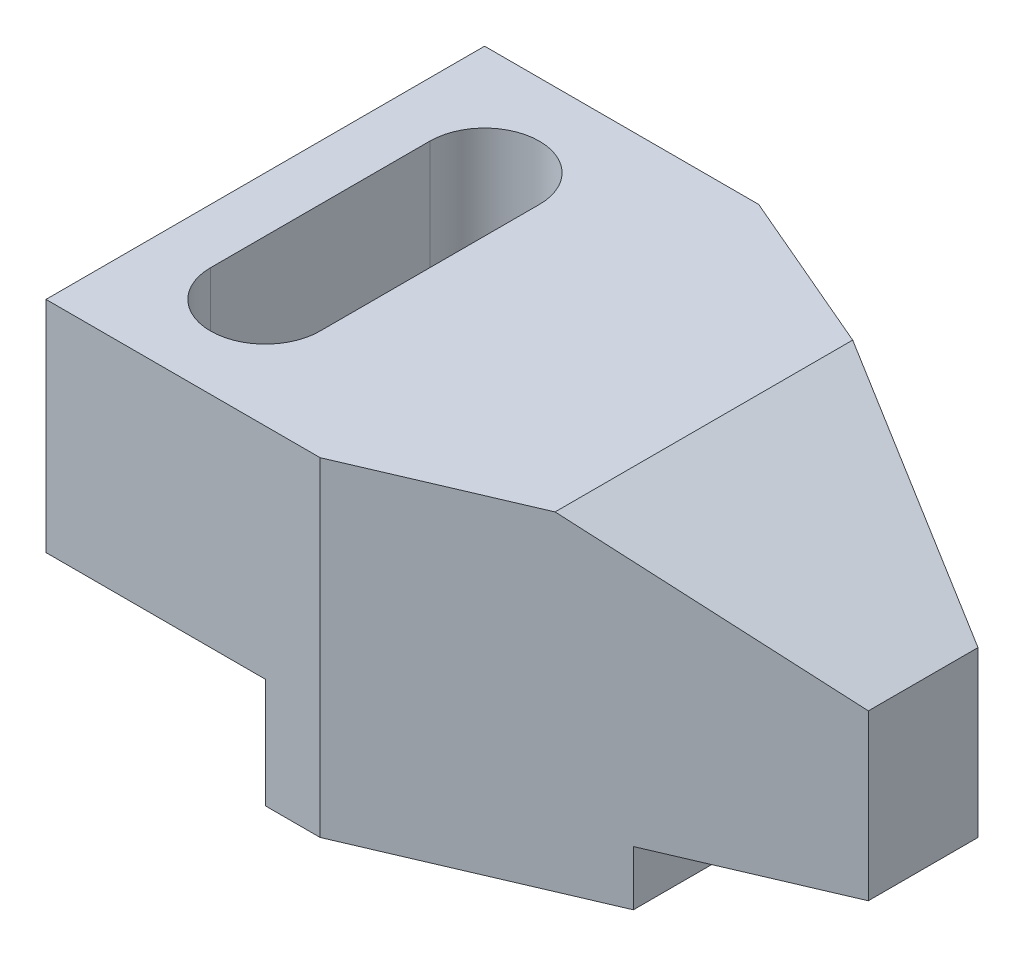
ISO-10303-21;
HEADER;
FILE_DESCRIPTION(('STEP AP214'),'2;1');
FILE_NAME('part.step','',(''),(''),'','','');
FILE_SCHEMA(('AUTOMOTIVE_DESIGN { 1 0 10303 214 1 1 1 1 }'));
ENDSEC;
DATA;
#1=APPLICATION_CONTEXT('core data for automotive mechanical design processes');
#2=APPLICATION_PROTOCOL_DEFINITION('international standard','automotive_design',2000,#1);
#3=PRODUCT_CONTEXT('',#1,'mechanical');
#4=PRODUCT('Part','Part','',(#3));
#5=PRODUCT_RELATED_PRODUCT_CATEGORY('part','',(#4));
#6=PRODUCT_DEFINITION_FORMATION('','',#4);
#7=PRODUCT_DEFINITION_CONTEXT('part definition',#1,'design');
#8=PRODUCT_DEFINITION('design','',#6,#7);
#9=PRODUCT_DEFINITION_SHAPE('','',#8);
#10=(LENGTH_UNIT() NAMED_UNIT(*) SI_UNIT(.MILLI.,.METRE.));
#11=(NAMED_UNIT(*) PLANE_ANGLE_UNIT() SI_UNIT($,.RADIAN.));
#12=(NAMED_UNIT(*) SI_UNIT($,.STERADIAN.) SOLID_ANGLE_UNIT());
#13=UNCERTAINTY_MEASURE_WITH_UNIT(LENGTH_MEASURE(1.E-05),#10,'distance_accuracy_value','');
#14=(GEOMETRIC_REPRESENTATION_CONTEXT(3) GLOBAL_UNCERTAINTY_ASSIGNED_CONTEXT((#13)) GLOBAL_UNIT_ASSIGNED_CONTEXT((#10,
#11,#12)) REPRESENTATION_CONTEXT('',''));
#15=CARTESIAN_POINT('',(0.,0.,0.));
#16=DIRECTION('',(0.,0.,1.));
#17=DIRECTION('',(1.,0.,0.));
#18=AXIS2_PLACEMENT_3D('',#15,#16,#17);
#19=CARTESIAN_POINT('',(100.,60.,0.));
#20=DIRECTION('',(1.,0.,0.));
#21=DIRECTION('',(0.,0.,-1.));
#22=AXIS2_PLACEMENT_3D('',#19,#20,#21);
#23=PLANE('',#22);
#24=DIRECTION('',(0.,0.,1.));
#25=VECTOR('',#24,1.);
#26=CARTESIAN_POINT('',(100.,40.,-40.));
#27=LINE('',#26,#25);
#28=CARTESIAN_POINT('',(100.,40.,-9.99999999999999));
#29=VERTEX_POINT('',#28);
#30=CARTESIAN_POINT('',(100.,40.,9.99999999999999));
#31=VERTEX_POINT('',#30);
#32=EDGE_CURVE('E138',#29,#31,#27,.T.);
#33=ORIENTED_EDGE('',*,*,#32,.T.);
#34=DIRECTION('',(0.,-1.,0.));
#35=VECTOR('',#34,1.);
#36=CARTESIAN_POINT('',(100.,60.,10.));
#37=LINE('',#36,#35);
#38=CARTESIAN_POINT('',(100.,10.,9.99999999999999));
#39=VERTEX_POINT('',#38);
#40=EDGE_CURVE('E158',#31,#39,#37,.T.);
#41=ORIENTED_EDGE('',*,*,#40,.T.);
#42=DIRECTION('',(0.,0.,1.));
#43=VECTOR('',#42,1.);
#44=CARTESIAN_POINT('',(100.,10.,0.));
#45=LINE('',#44,#43);
#46=CARTESIAN_POINT('',(100.,10.,-9.99999999999999));
#47=VERTEX_POINT('',#46);
#48=EDGE_CURVE('E157',#47,#39,#45,.T.);
#49=ORIENTED_EDGE('',*,*,#48,.F.);
#50=DIRECTION('',(0.,-1.,0.));
#51=VECTOR('',#50,1.);
#52=CARTESIAN_POINT('',(100.,60.,-9.99999999999999));
#53=LINE('',#52,#51);
#54=EDGE_CURVE('E150',#29,#47,#53,.T.);
#55=ORIENTED_EDGE('',*,*,#54,.F.);
#56=EDGE_LOOP('',(#33,#41,#49,#55));
#57=FACE_BOUND('',#56,.T.);
#58=ADVANCED_FACE('F33',(#57),#23,.T.);
#59=CARTESIAN_POINT('',(-20.,60.,0.));
#60=DIRECTION('',(-1.,0.,0.));
#61=DIRECTION('',(0.,0.,1.));
#62=AXIS2_PLACEMENT_3D('',#59,#60,#61);
#63=PLANE('',#62);
#64=DIRECTION('',(0.,0.,1.));
#65=VECTOR('',#64,1.);
#66=CARTESIAN_POINT('',(-20.,20.,-40.));
#67=LINE('',#66,#65);
#68=CARTESIAN_POINT('',(-20.,20.,-40.));
#69=VERTEX_POINT('',#68);
#70=CARTESIAN_POINT('',(-20.,20.,40.));
#71=VERTEX_POINT('',#70);
#72=EDGE_CURVE('E231',#69,#71,#67,.T.);
#73=ORIENTED_EDGE('',*,*,#72,.T.);
#74=DIRECTION('',(0.,-1.,0.));
#75=VECTOR('',#74,1.);
#76=CARTESIAN_POINT('',(-20.,60.,40.));
#77=LINE('',#76,#75);
#78=CARTESIAN_POINT('',(-20.,60.,40.));
#79=VERTEX_POINT('',#78);
#80=EDGE_CURVE('E169',#79,#71,#77,.T.);
#81=ORIENTED_EDGE('',*,*,#80,.F.);
#82=DIRECTION('',(0.,0.,-1.));
#83=VECTOR('',#82,1.);
#84=CARTESIAN_POINT('',(-20.,60.,0.));
#85=LINE('',#84,#83);
#86=CARTESIAN_POINT('',(-20.,60.,-40.));
#87=VERTEX_POINT('',#86);
#88=EDGE_CURVE('E238',#79,#87,#85,.T.);
#89=ORIENTED_EDGE('',*,*,#88,.T.);
#90=DIRECTION('',(0.,-1.,0.));
#91=VECTOR('',#90,1.);
#92=CARTESIAN_POINT('',(-20.,60.,-40.));
#93=LINE('',#92,#91);
#94=EDGE_CURVE('E163',#87,#69,#93,.T.);
#95=ORIENTED_EDGE('',*,*,#94,.T.);
#96=EDGE_LOOP('',(#73,#81,#89,#95));
#97=FACE_BOUND('',#96,.T.);
#98=ADVANCED_FACE('F35',(#97),#63,.T.);
#99=CARTESIAN_POINT('',(0.,60.,40.));
#100=DIRECTION('',(0.,0.,1.));
#101=DIRECTION('',(1.,0.,0.));
#102=AXIS2_PLACEMENT_3D('',#99,#100,#101);
#103=PLANE('',#102);
#104=DIRECTION('',(-1.,0.,0.));
#105=VECTOR('',#104,1.);
#106=CARTESIAN_POINT('',(-20.,20.,40.));
#107=LINE('',#106,#105);
#108=CARTESIAN_POINT('',(20.,20.,40.));
#109=VERTEX_POINT('',#108);
#110=EDGE_CURVE('E224',#109,#71,#107,.T.);
#111=ORIENTED_EDGE('',*,*,#110,.F.);
#112=DIRECTION('',(0.,1.,0.));
#113=VECTOR('',#112,1.);
#114=CARTESIAN_POINT('',(20.,0.,40.));
#115=LINE('',#114,#113);
#116=CARTESIAN_POINT('',(20.,0.,40.));
#117=VERTEX_POINT('',#116);
#118=EDGE_CURVE('E218',#117,#109,#115,.T.);
#119=ORIENTED_EDGE('',*,*,#118,.F.);
#120=DIRECTION('',(-1.,0.,0.));
#121=VECTOR('',#120,1.);
#122=CARTESIAN_POINT('',(0.,0.,40.));
#123=LINE('',#122,#121);
#124=CARTESIAN_POINT('',(30.,0.,40.));
#125=VERTEX_POINT('',#124);
#126=EDGE_CURVE('E234',#125,#117,#123,.T.);
#127=ORIENTED_EDGE('',*,*,#126,.F.);
#128=DIRECTION('',(0.,-1.,0.));
#129=VECTOR('',#128,1.);
#130=CARTESIAN_POINT('',(30.,60.,40.));
#131=LINE('',#130,#129);
#132=CARTESIAN_POINT('',(30.,60.,40.));
#133=VERTEX_POINT('',#132);
#134=EDGE_CURVE('E161',#133,#125,#131,.T.);
#135=ORIENTED_EDGE('',*,*,#134,.F.);
#136=DIRECTION('',(-1.,0.,0.));
#137=VECTOR('',#136,1.);
#138=CARTESIAN_POINT('',(0.,60.,40.));
#139=LINE('',#138,#137);
#140=EDGE_CURVE('E241',#133,#79,#139,.T.);
#141=ORIENTED_EDGE('',*,*,#140,.T.);
#142=ORIENTED_EDGE('',*,*,#80,.T.);
#143=EDGE_LOOP('',(#111,#119,#127,#135,#141,#142));
#144=FACE_BOUND('',#143,.T.);
#145=ADVANCED_FACE('F269',(#144),#103,.T.);
#146=CARTESIAN_POINT('',(19.1379310344828,60.,44.6551724137931));
#147=DIRECTION('',(0.393919298579168,0.,0.919145030018058));
#148=DIRECTION('',(0.919145030018058,0.,-0.393919298579168));
#149=AXIS2_PLACEMENT_3D('',#146,#147,#148);
#150=PLANE('',#149);
#151=DIRECTION('',(0.835169980780651,-0.417584990390326,-0.357929991763136));
#152=VECTOR('',#151,1.);
#153=CARTESIAN_POINT('',(26.2633451957295,76.8683274021352,41.6014234875445));
#154=LINE('',#153,#152);
#155=CARTESIAN_POINT('',(60.,60.,27.1428571428571));
#156=VERTEX_POINT('',#155);
#157=EDGE_CURVE('E141',#156,#31,#154,.T.);
#158=ORIENTED_EDGE('',*,*,#157,.F.);
#159=DIRECTION('',(-0.919145030018058,0.,0.393919298579168));
#160=VECTOR('',#159,1.);
#161=CARTESIAN_POINT('',(19.1379310344828,60.,44.6551724137931));
#162=LINE('',#161,#160);
#163=EDGE_CURVE('E245',#156,#133,#162,.T.);
#164=ORIENTED_EDGE('',*,*,#163,.T.);
#165=ORIENTED_EDGE('',*,*,#134,.T.);
#166=DIRECTION('',(-0.919145030018058,0.,0.393919298579168));
#167=VECTOR('',#166,1.);
#168=CARTESIAN_POINT('',(19.1379310344828,0.,44.6551724137931));
#169=LINE('',#168,#167);
#170=CARTESIAN_POINT('',(70.,0.,22.8571428571429));
#171=VERTEX_POINT('',#170);
#172=EDGE_CURVE('E252',#171,#125,#169,.T.);
#173=ORIENTED_EDGE('',*,*,#172,.F.);
#174=DIRECTION('',(0.,-1.,0.));
#175=VECTOR('',#174,1.);
#176=CARTESIAN_POINT('',(70.,10.,22.8571428571429));
#177=LINE('',#176,#175);
#178=CARTESIAN_POINT('',(70.,10.,22.8571428571429));
#179=VERTEX_POINT('',#178);
#180=EDGE_CURVE('E213',#179,#171,#177,.T.);
#181=ORIENTED_EDGE('',*,*,#180,.F.);
#182=DIRECTION('',(-0.919145030018058,0.,0.393919298579168));
#183=VECTOR('',#182,1.);
#184=CARTESIAN_POINT('',(19.1379310344828,10.,44.6551724137931));
#185=LINE('',#184,#183);
#186=EDGE_CURVE('E197',#39,#179,#185,.T.);
#187=ORIENTED_EDGE('',*,*,#186,.F.);
#188=ORIENTED_EDGE('',*,*,#40,.F.);
#189=EDGE_LOOP('',(#158,#164,#165,#173,#181,#187,#188));
#190=FACE_BOUND('',#189,.T.);
#191=ADVANCED_FACE('F278',(#190),#150,.T.);
#192=CARTESIAN_POINT('',(19.1379310344827,60.,-44.6551724137931));
#193=DIRECTION('',(0.393919298579168,0.,-0.919145030018058));
#194=DIRECTION('',(-0.919145030018058,0.,-0.393919298579168));
#195=AXIS2_PLACEMENT_3D('',#192,#193,#194);
#196=PLANE('',#195);
#197=DIRECTION('',(-0.835169980780651,0.417584990390326,-0.357929991763136));
#198=VECTOR('',#197,1.);
#199=CARTESIAN_POINT('',(26.2633451957295,76.8683274021352,-41.6014234875445));
#200=LINE('',#199,#198);
#201=CARTESIAN_POINT('',(60.,60.,-27.1428571428571));
#202=VERTEX_POINT('',#201);
#203=EDGE_CURVE('E47',#29,#202,#200,.T.);
#204=ORIENTED_EDGE('',*,*,#203,.F.);
#205=ORIENTED_EDGE('',*,*,#54,.T.);
#206=DIRECTION('',(0.919145030018058,0.,0.393919298579168));
#207=VECTOR('',#206,1.);
#208=CARTESIAN_POINT('',(19.1379310344827,10.,-44.6551724137931));
#209=LINE('',#208,#207);
#210=CARTESIAN_POINT('',(70.,10.,-22.8571428571428));
#211=VERTEX_POINT('',#210);
#212=EDGE_CURVE('E211',#211,#47,#209,.T.);
#213=ORIENTED_EDGE('',*,*,#212,.F.);
#214=DIRECTION('',(0.,-1.,0.));
#215=VECTOR('',#214,1.);
#216=CARTESIAN_POINT('',(70.,10.,-22.8571428571428));
#217=LINE('',#216,#215);
#218=CARTESIAN_POINT('',(70.,0.,-22.8571428571428));
#219=VERTEX_POINT('',#218);
#220=EDGE_CURVE('E215',#211,#219,#217,.T.);
#221=ORIENTED_EDGE('',*,*,#220,.T.);
#222=DIRECTION('',(0.919145030018058,0.,0.393919298579168));
#223=VECTOR('',#222,1.);
#224=CARTESIAN_POINT('',(19.1379310344827,0.,-44.6551724137931));
#225=LINE('',#224,#223);
#226=CARTESIAN_POINT('',(30.,0.,-40.));
#227=VERTEX_POINT('',#226);
#228=EDGE_CURVE('E254',#227,#219,#225,.T.);
#229=ORIENTED_EDGE('',*,*,#228,.F.);
#230=DIRECTION('',(0.,-1.,0.));
#231=VECTOR('',#230,1.);
#232=CARTESIAN_POINT('',(30.,60.,-40.));
#233=LINE('',#232,#231);
#234=CARTESIAN_POINT('',(30.,60.,-40.));
#235=VERTEX_POINT('',#234);
#236=EDGE_CURVE('E159',#235,#227,#233,.T.);
#237=ORIENTED_EDGE('',*,*,#236,.F.);
#238=DIRECTION('',(0.919145030018058,0.,0.393919298579168));
#239=VECTOR('',#238,1.);
#240=CARTESIAN_POINT('',(19.1379310344827,60.,-44.6551724137931));
#241=LINE('',#240,#239);
#242=EDGE_CURVE('E153',#235,#202,#241,.T.);
#243=ORIENTED_EDGE('',*,*,#242,.T.);
#244=EDGE_LOOP('',(#204,#205,#213,#221,#229,#237,#243));
#245=FACE_BOUND('',#244,.T.);
#246=ADVANCED_FACE('F148',(#245),#196,.T.);
#247=CARTESIAN_POINT('',(0.,60.,-40.));
#248=DIRECTION('',(0.,0.,1.));
#249=DIRECTION('',(1.,0.,0.));
#250=AXIS2_PLACEMENT_3D('',#247,#248,#249);
#251=PLANE('',#250);
#252=DIRECTION('',(0.,1.,0.));
#253=VECTOR('',#252,1.);
#254=CARTESIAN_POINT('',(20.,0.,-40.));
#255=LINE('',#254,#253);
#256=CARTESIAN_POINT('',(20.,0.,-40.));
#257=VERTEX_POINT('',#256);
#258=CARTESIAN_POINT('',(20.,20.,-40.));
#259=VERTEX_POINT('',#258);
#260=EDGE_CURVE('E220',#257,#259,#255,.T.);
#261=ORIENTED_EDGE('',*,*,#260,.T.);
#262=DIRECTION('',(-1.,0.,0.));
#263=VECTOR('',#262,1.);
#264=CARTESIAN_POINT('',(-20.,20.,-40.));
#265=LINE('',#264,#263);
#266=EDGE_CURVE('E223',#259,#69,#265,.T.);
#267=ORIENTED_EDGE('',*,*,#266,.T.);
#268=ORIENTED_EDGE('',*,*,#94,.F.);
#269=DIRECTION('',(-1.,0.,0.));
#270=VECTOR('',#269,1.);
#271=CARTESIAN_POINT('',(0.,60.,-40.));
#272=LINE('',#271,#270);
#273=EDGE_CURVE('E248',#235,#87,#272,.T.);
#274=ORIENTED_EDGE('',*,*,#273,.F.);
#275=ORIENTED_EDGE('',*,*,#236,.T.);
#276=DIRECTION('',(-1.,0.,0.));
#277=VECTOR('',#276,1.);
#278=CARTESIAN_POINT('',(0.,0.,-40.));
#279=LINE('',#278,#277);
#280=EDGE_CURVE('E242',#227,#257,#279,.T.);
#281=ORIENTED_EDGE('',*,*,#280,.T.);
#282=EDGE_LOOP('',(#261,#267,#268,#274,#275,#281));
#283=FACE_BOUND('',#282,.T.);
#284=ADVANCED_FACE('F264',(#283),#251,.F.);
#285=CARTESIAN_POINT('',(0.,60.,0.));
#286=DIRECTION('',(0.,1.,0.));
#287=DIRECTION('',(0.,0.,1.));
#288=AXIS2_PLACEMENT_3D('',#285,#286,#287);
#289=PLANE('',#288);
#290=DIRECTION('',(0.,0.,1.));
#291=VECTOR('',#290,1.);
#292=CARTESIAN_POINT('',(60.,60.,0.));
#293=LINE('',#292,#291);
#294=EDGE_CURVE('E11',#202,#156,#293,.T.);
#295=ORIENTED_EDGE('',*,*,#294,.F.);
#296=ORIENTED_EDGE('',*,*,#242,.F.);
#297=ORIENTED_EDGE('',*,*,#273,.T.);
#298=ORIENTED_EDGE('',*,*,#88,.F.);
#299=ORIENTED_EDGE('',*,*,#140,.F.);
#300=ORIENTED_EDGE('',*,*,#163,.F.);
#301=EDGE_LOOP('',(#295,#296,#297,#298,#299,#300));
#302=FACE_BOUND('',#301,.T.);
#303=CARTESIAN_POINT('',(0.,60.,20.));
#304=DIRECTION('',(0.,1.,0.));
#305=DIRECTION('',(0.,0.,1.));
#306=AXIS2_PLACEMENT_3D('',#303,#304,#305);
#307=CIRCLE('',#306,10.);
#308=CARTESIAN_POINT('',(-10.,60.,20.));
#309=VERTEX_POINT('',#308);
#310=CARTESIAN_POINT('',(10.,60.,20.));
#311=VERTEX_POINT('',#310);
#312=EDGE_CURVE('E55',#309,#311,#307,.T.);
#313=ORIENTED_EDGE('',*,*,#312,.F.);
#314=DIRECTION('',(0.,0.,1.));
#315=VECTOR('',#314,1.);
#316=CARTESIAN_POINT('',(-10.,60.,20.));
#317=LINE('',#316,#315);
#318=CARTESIAN_POINT('',(-10.,60.,-20.));
#319=VERTEX_POINT('',#318);
#320=EDGE_CURVE('E193',#319,#309,#317,.T.);
#321=ORIENTED_EDGE('',*,*,#320,.F.);
#322=CARTESIAN_POINT('',(0.,60.,-20.));
#323=DIRECTION('',(0.,1.,0.));
#324=DIRECTION('',(0.,0.,1.));
#325=AXIS2_PLACEMENT_3D('',#322,#323,#324);
#326=CIRCLE('',#325,10.);
#327=CARTESIAN_POINT('',(10.,60.,-20.));
#328=VERTEX_POINT('',#327);
#329=EDGE_CURVE('E285',#328,#319,#326,.T.);
#330=ORIENTED_EDGE('',*,*,#329,.F.);
#331=DIRECTION('',(0.,0.,-1.));
#332=VECTOR('',#331,1.);
#333=CARTESIAN_POINT('',(10.,60.,20.));
#334=LINE('',#333,#332);
#335=EDGE_CURVE('E281',#311,#328,#334,.T.);
#336=ORIENTED_EDGE('',*,*,#335,.F.);
#337=EDGE_LOOP('',(#313,#321,#330,#336));
#338=FACE_BOUND('',#337,.T.);
#339=ADVANCED_FACE('F274',(#302,#338),#289,.T.);
#340=CARTESIAN_POINT('',(0.,0.,0.));
#341=DIRECTION('',(0.,1.,0.));
#342=DIRECTION('',(0.,0.,1.));
#343=AXIS2_PLACEMENT_3D('',#340,#341,#342);
#344=PLANE('',#343);
#345=ORIENTED_EDGE('',*,*,#228,.T.);
#346=DIRECTION('',(0.,0.,-1.));
#347=VECTOR('',#346,1.);
#348=CARTESIAN_POINT('',(70.,0.,0.));
#349=LINE('',#348,#347);
#350=EDGE_CURVE('E194',#171,#219,#349,.T.);
#351=ORIENTED_EDGE('',*,*,#350,.F.);
#352=ORIENTED_EDGE('',*,*,#172,.T.);
#353=ORIENTED_EDGE('',*,*,#126,.T.);
#354=DIRECTION('',(0.,0.,1.));
#355=VECTOR('',#354,1.);
#356=CARTESIAN_POINT('',(20.,0.,-40.));
#357=LINE('',#356,#355);
#358=EDGE_CURVE('E227',#257,#117,#357,.T.);
#359=ORIENTED_EDGE('',*,*,#358,.F.);
#360=ORIENTED_EDGE('',*,*,#280,.F.);
#361=EDGE_LOOP('',(#345,#351,#352,#353,#359,#360));
#362=FACE_BOUND('',#361,.T.);
#363=ADVANCED_FACE('F338',(#362),#344,.F.);
#364=CARTESIAN_POINT('',(-20.,20.,-40.));
#365=DIRECTION('',(0.,1.,0.));
#366=DIRECTION('',(0.,0.,1.));
#367=AXIS2_PLACEMENT_3D('',#364,#365,#366);
#368=PLANE('',#367);
#369=DIRECTION('',(0.,0.,1.));
#370=VECTOR('',#369,1.);
#371=CARTESIAN_POINT('',(-10.,20.,-40.));
#372=LINE('',#371,#370);
#373=CARTESIAN_POINT('',(-10.,20.,-20.));
#374=VERTEX_POINT('',#373);
#375=CARTESIAN_POINT('',(-10.,20.,20.));
#376=VERTEX_POINT('',#375);
#377=EDGE_CURVE('E178',#374,#376,#372,.T.);
#378=ORIENTED_EDGE('',*,*,#377,.T.);
#379=CARTESIAN_POINT('',(0.,20.,20.));
#380=DIRECTION('',(0.,1.,0.));
#381=DIRECTION('',(0.,0.,1.));
#382=AXIS2_PLACEMENT_3D('',#379,#380,#381);
#383=CIRCLE('',#382,10.);
#384=CARTESIAN_POINT('',(10.,20.,20.));
#385=VERTEX_POINT('',#384);
#386=EDGE_CURVE('E41',#376,#385,#383,.T.);
#387=ORIENTED_EDGE('',*,*,#386,.T.);
#388=DIRECTION('',(0.,0.,-1.));
#389=VECTOR('',#388,1.);
#390=CARTESIAN_POINT('',(10.,20.,-40.));
#391=LINE('',#390,#389);
#392=CARTESIAN_POINT('',(10.,20.,-20.));
#393=VERTEX_POINT('',#392);
#394=EDGE_CURVE('E172',#385,#393,#391,.T.);
#395=ORIENTED_EDGE('',*,*,#394,.T.);
#396=CARTESIAN_POINT('',(0.,20.,-20.));
#397=DIRECTION('',(0.,1.,0.));
#398=DIRECTION('',(0.,0.,1.));
#399=AXIS2_PLACEMENT_3D('',#396,#397,#398);
#400=CIRCLE('',#399,10.);
#401=EDGE_CURVE('E175',#393,#374,#400,.T.);
#402=ORIENTED_EDGE('',*,*,#401,.T.);
#403=EDGE_LOOP('',(#378,#387,#395,#402));
#404=FACE_BOUND('',#403,.T.);
#405=ORIENTED_EDGE('',*,*,#110,.T.);
#406=ORIENTED_EDGE('',*,*,#72,.F.);
#407=ORIENTED_EDGE('',*,*,#266,.F.);
#408=DIRECTION('',(0.,0.,1.));
#409=VECTOR('',#408,1.);
#410=CARTESIAN_POINT('',(20.,20.,-40.));
#411=LINE('',#410,#409);
#412=EDGE_CURVE('E235',#259,#109,#411,.T.);
#413=ORIENTED_EDGE('',*,*,#412,.T.);
#414=EDGE_LOOP('',(#405,#406,#407,#413));
#415=FACE_BOUND('',#414,.T.);
#416=ADVANCED_FACE('F182',(#404,#415),#368,.F.);
#417=CARTESIAN_POINT('',(20.,0.,-40.));
#418=DIRECTION('',(1.,0.,0.));
#419=DIRECTION('',(0.,0.,-1.));
#420=AXIS2_PLACEMENT_3D('',#417,#418,#419);
#421=PLANE('',#420);
#422=ORIENTED_EDGE('',*,*,#118,.T.);
#423=ORIENTED_EDGE('',*,*,#412,.F.);
#424=ORIENTED_EDGE('',*,*,#260,.F.);
#425=ORIENTED_EDGE('',*,*,#358,.T.);
#426=EDGE_LOOP('',(#422,#423,#424,#425));
#427=FACE_BOUND('',#426,.T.);
#428=ADVANCED_FACE('F354',(#427),#421,.F.);
#429=CARTESIAN_POINT('',(70.,10.,0.));
#430=DIRECTION('',(-1.,0.,0.));
#431=DIRECTION('',(0.,0.,1.));
#432=AXIS2_PLACEMENT_3D('',#429,#430,#431);
#433=PLANE('',#432);
#434=ORIENTED_EDGE('',*,*,#350,.T.);
#435=ORIENTED_EDGE('',*,*,#220,.F.);
#436=DIRECTION('',(0.,0.,-1.));
#437=VECTOR('',#436,1.);
#438=CARTESIAN_POINT('',(70.,10.,0.));
#439=LINE('',#438,#437);
#440=EDGE_CURVE('E208',#179,#211,#439,.T.);
#441=ORIENTED_EDGE('',*,*,#440,.F.);
#442=ORIENTED_EDGE('',*,*,#180,.T.);
#443=EDGE_LOOP('',(#434,#435,#441,#442));
#444=FACE_BOUND('',#443,.T.);
#445=ADVANCED_FACE('F362',(#444),#433,.F.);
#446=CARTESIAN_POINT('',(0.,10.,0.));
#447=DIRECTION('',(0.,-1.,0.));
#448=DIRECTION('',(0.,0.,-1.));
#449=AXIS2_PLACEMENT_3D('',#446,#447,#448);
#450=PLANE('',#449);
#451=ORIENTED_EDGE('',*,*,#186,.T.);
#452=ORIENTED_EDGE('',*,*,#440,.T.);
#453=ORIENTED_EDGE('',*,*,#212,.T.);
#454=ORIENTED_EDGE('',*,*,#48,.T.);
#455=EDGE_LOOP('',(#451,#452,#453,#454));
#456=FACE_BOUND('',#455,.T.);
#457=ADVANCED_FACE('F369',(#456),#450,.T.);
#458=CARTESIAN_POINT('',(0.,0.,20.));
#459=DIRECTION('',(0.,1.,0.));
#460=DIRECTION('',(0.,0.,1.));
#461=AXIS2_PLACEMENT_3D('',#458,#459,#460);
#462=CYLINDRICAL_SURFACE('',#461,10.);
#463=DIRECTION('',(0.,1.,0.));
#464=VECTOR('',#463,1.);
#465=CARTESIAN_POINT('',(-10.,0.,20.));
#466=LINE('',#465,#464);
#467=EDGE_CURVE('E186',#376,#309,#466,.T.);
#468=ORIENTED_EDGE('',*,*,#467,.T.);
#469=ORIENTED_EDGE('',*,*,#312,.T.);
#470=DIRECTION('',(0.,1.,0.));
#471=VECTOR('',#470,1.);
#472=CARTESIAN_POINT('',(10.,0.,20.));
#473=LINE('',#472,#471);
#474=EDGE_CURVE('E188',#385,#311,#473,.T.);
#475=ORIENTED_EDGE('',*,*,#474,.F.);
#476=ORIENTED_EDGE('',*,*,#386,.F.);
#477=EDGE_LOOP('',(#468,#469,#475,#476));
#478=FACE_BOUND('',#477,.T.);
#479=ADVANCED_FACE('F185',(#478),#462,.F.);
#480=CARTESIAN_POINT('',(-10.,0.,20.));
#481=DIRECTION('',(-1.,0.,0.));
#482=DIRECTION('',(0.,0.,1.));
#483=AXIS2_PLACEMENT_3D('',#480,#481,#482);
#484=PLANE('',#483);
#485=DIRECTION('',(0.,1.,0.));
#486=VECTOR('',#485,1.);
#487=CARTESIAN_POINT('',(-10.,0.,-20.));
#488=LINE('',#487,#486);
#489=EDGE_CURVE('E195',#374,#319,#488,.T.);
#490=ORIENTED_EDGE('',*,*,#489,.T.);
#491=ORIENTED_EDGE('',*,*,#320,.T.);
#492=ORIENTED_EDGE('',*,*,#467,.F.);
#493=ORIENTED_EDGE('',*,*,#377,.F.);
#494=EDGE_LOOP('',(#490,#491,#492,#493));
#495=FACE_BOUND('',#494,.T.);
#496=ADVANCED_FACE('F190',(#495),#484,.F.);
#497=CARTESIAN_POINT('',(0.,0.,-20.));
#498=DIRECTION('',(0.,1.,0.));
#499=DIRECTION('',(0.,0.,1.));
#500=AXIS2_PLACEMENT_3D('',#497,#498,#499);
#501=CYLINDRICAL_SURFACE('',#500,10.);
#502=DIRECTION('',(0.,1.,0.));
#503=VECTOR('',#502,1.);
#504=CARTESIAN_POINT('',(10.,0.,-20.));
#505=LINE('',#504,#503);
#506=EDGE_CURVE('E199',#393,#328,#505,.T.);
#507=ORIENTED_EDGE('',*,*,#506,.T.);
#508=ORIENTED_EDGE('',*,*,#329,.T.);
#509=ORIENTED_EDGE('',*,*,#489,.F.);
#510=ORIENTED_EDGE('',*,*,#401,.F.);
#511=EDGE_LOOP('',(#507,#508,#509,#510));
#512=FACE_BOUND('',#511,.T.);
#513=ADVANCED_FACE('F289',(#512),#501,.F.);
#514=CARTESIAN_POINT('',(10.,0.,20.));
#515=DIRECTION('',(1.,0.,0.));
#516=DIRECTION('',(0.,0.,-1.));
#517=AXIS2_PLACEMENT_3D('',#514,#515,#516);
#518=PLANE('',#517);
#519=ORIENTED_EDGE('',*,*,#474,.T.);
#520=ORIENTED_EDGE('',*,*,#335,.T.);
#521=ORIENTED_EDGE('',*,*,#506,.F.);
#522=ORIENTED_EDGE('',*,*,#394,.F.);
#523=EDGE_LOOP('',(#519,#520,#521,#522));
#524=FACE_BOUND('',#523,.T.);
#525=ADVANCED_FACE('F293',(#524),#518,.F.);
#526=CARTESIAN_POINT('',(60.,60.,-40.));
#527=DIRECTION('',(-0.447213595499958,-0.894427190999916,0.));
#528=DIRECTION('',(0.894427190999916,-0.447213595499958,0.));
#529=AXIS2_PLACEMENT_3D('',#526,#527,#528);
#530=PLANE('',#529);
#531=ORIENTED_EDGE('',*,*,#157,.T.);
#532=ORIENTED_EDGE('',*,*,#32,.F.);
#533=ORIENTED_EDGE('',*,*,#203,.T.);
#534=ORIENTED_EDGE('',*,*,#294,.T.);
#535=EDGE_LOOP('',(#531,#532,#533,#534));
#536=FACE_BOUND('',#535,.T.);
#537=ADVANCED_FACE('F139',(#536),#530,.F.);
#538=CLOSED_SHELL('',(#58,#98,#145,#191,#246,#284,#339,#363,#416,#428,#445,#457,#479,#496,#513,
#525,#537));
#539=MANIFOLD_SOLID_BREP('B2',#538);
#540=ADVANCED_BREP_SHAPE_REPRESENTATION('',(#18,#539),#14);
#541=SHAPE_DEFINITION_REPRESENTATION(#9,#540);
ENDSEC;
END-ISO-10303-21;
